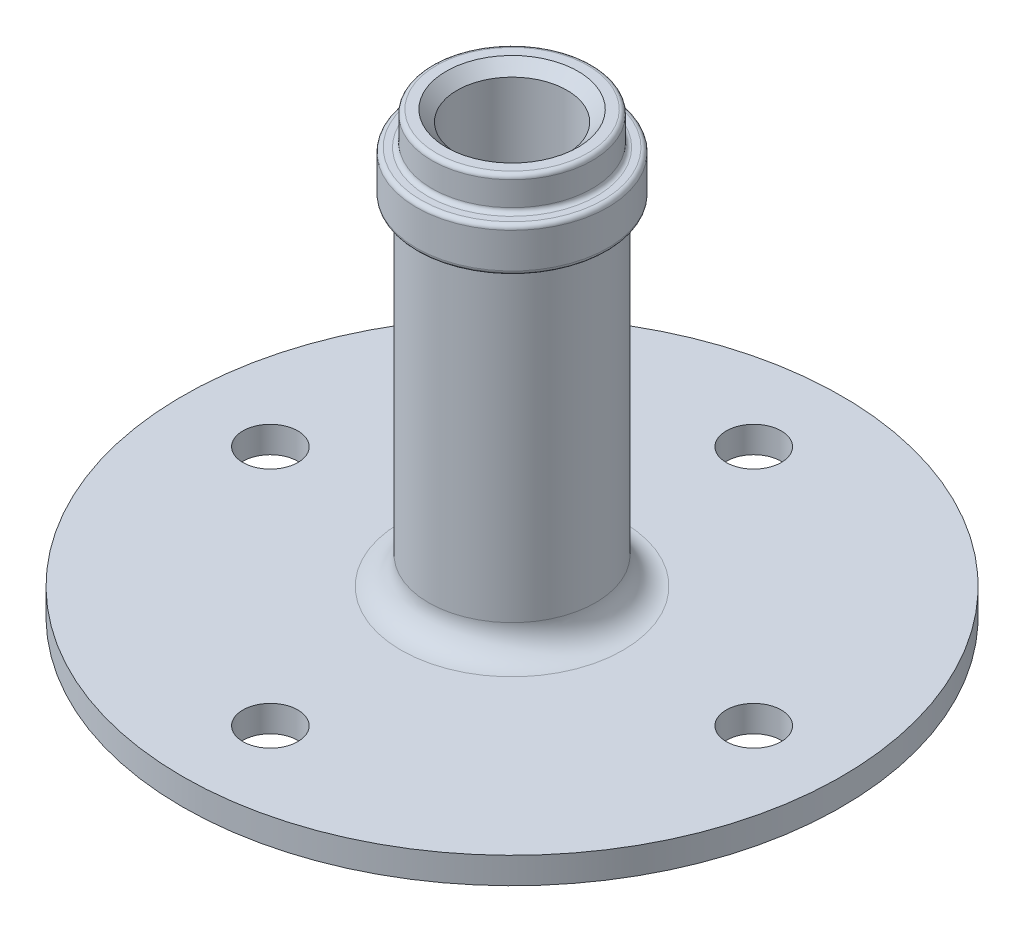
ISO-10303-21;
HEADER;
FILE_DESCRIPTION(('STEP AP214'),'2;1');
FILE_NAME('part.step','',(''),(''),'','','');
FILE_SCHEMA(('AUTOMOTIVE_DESIGN { 1 0 10303 214 1 1 1 1 }'));
ENDSEC;
DATA;
#1=APPLICATION_CONTEXT('core data for automotive mechanical design processes');
#2=APPLICATION_PROTOCOL_DEFINITION('international standard','automotive_design',2000,#1);
#3=PRODUCT_CONTEXT('',#1,'mechanical');
#4=PRODUCT('Part','Part','',(#3));
#5=PRODUCT_RELATED_PRODUCT_CATEGORY('part','',(#4));
#6=PRODUCT_DEFINITION_FORMATION('','',#4);
#7=PRODUCT_DEFINITION_CONTEXT('part definition',#1,'design');
#8=PRODUCT_DEFINITION('design','',#6,#7);
#9=PRODUCT_DEFINITION_SHAPE('','',#8);
#10=(LENGTH_UNIT() NAMED_UNIT(*) SI_UNIT(.MILLI.,.METRE.));
#11=(NAMED_UNIT(*) PLANE_ANGLE_UNIT() SI_UNIT($,.RADIAN.));
#12=(NAMED_UNIT(*) SI_UNIT($,.STERADIAN.) SOLID_ANGLE_UNIT());
#13=UNCERTAINTY_MEASURE_WITH_UNIT(LENGTH_MEASURE(1.E-05),#10,'distance_accuracy_value','');
#14=(GEOMETRIC_REPRESENTATION_CONTEXT(3) GLOBAL_UNCERTAINTY_ASSIGNED_CONTEXT((#13)) GLOBAL_UNIT_ASSIGNED_CONTEXT((#10,
#11,#12)) REPRESENTATION_CONTEXT('',''));
#15=CARTESIAN_POINT('',(0.,0.,0.));
#16=DIRECTION('',(0.,0.,1.));
#17=DIRECTION('',(1.,0.,0.));
#18=AXIS2_PLACEMENT_3D('',#15,#16,#17);
#19=CARTESIAN_POINT('',(0.,25.146,0.));
#20=DIRECTION('',(0.,1.,0.));
#21=DIRECTION('',(0.,0.,1.));
#22=AXIS2_PLACEMENT_3D('',#19,#20,#21);
#23=TOROIDAL_SURFACE('',#22,4.3815,0.254);
#24=CARTESIAN_POINT('',(0.,25.4,0.));
#25=DIRECTION('',(0.,1.,0.));
#26=DIRECTION('',(0.,0.,1.));
#27=AXIS2_PLACEMENT_3D('',#24,#25,#26);
#28=CIRCLE('',#27,4.3815);
#29=CARTESIAN_POINT('',(0.,25.4,4.3815));
#30=VERTEX_POINT('',#29);
#31=EDGE_CURVE('E357',#30,#30,#28,.T.);
#32=ORIENTED_EDGE('',*,*,#31,.F.);
#33=EDGE_LOOP('',(#32));
#34=FACE_BOUND('',#33,.T.);
#35=CARTESIAN_POINT('',(0.,25.146,0.));
#36=DIRECTION('',(0.,1.,0.));
#37=DIRECTION('',(0.,0.,1.));
#38=AXIS2_PLACEMENT_3D('',#35,#36,#37);
#39=CIRCLE('',#38,4.6355);
#40=CARTESIAN_POINT('',(0.,25.146,4.6355));
#41=VERTEX_POINT('',#40);
#42=EDGE_CURVE('E11',#41,#41,#39,.T.);
#43=ORIENTED_EDGE('',*,*,#42,.T.);
#44=EDGE_LOOP('',(#43));
#45=FACE_BOUND('',#44,.T.);
#46=ADVANCED_FACE('F302',(#34,#45),#23,.T.);
#47=CARTESIAN_POINT('',(0.,26.6065,0.));
#48=DIRECTION('',(0.,1.,0.));
#49=DIRECTION('',(0.,0.,1.));
#50=AXIS2_PLACEMENT_3D('',#47,#48,#49);
#51=CYLINDRICAL_SURFACE('',#50,4.6355);
#52=ORIENTED_EDGE('',*,*,#42,.F.);
#53=EDGE_LOOP('',(#52));
#54=FACE_BOUND('',#53,.T.);
#55=CARTESIAN_POINT('',(0.,23.749,0.));
#56=DIRECTION('',(0.,1.,0.));
#57=DIRECTION('',(0.,0.,1.));
#58=AXIS2_PLACEMENT_3D('',#55,#56,#57);
#59=CIRCLE('',#58,4.6355);
#60=CARTESIAN_POINT('',(0.,23.749,4.6355));
#61=VERTEX_POINT('',#60);
#62=EDGE_CURVE('E308',#61,#61,#59,.T.);
#63=ORIENTED_EDGE('',*,*,#62,.T.);
#64=EDGE_LOOP('',(#63));
#65=FACE_BOUND('',#64,.T.);
#66=ADVANCED_FACE('F441',(#54,#65),#51,.T.);
#67=CARTESIAN_POINT('',(0.,23.749,0.));
#68=DIRECTION('',(0.,1.,0.));
#69=DIRECTION('',(0.,0.,1.));
#70=AXIS2_PLACEMENT_3D('',#67,#68,#69);
#71=TOROIDAL_SURFACE('',#70,4.8895,0.254000000000001);
#72=ORIENTED_EDGE('',*,*,#62,.F.);
#73=EDGE_LOOP('',(#72));
#74=FACE_BOUND('',#73,.T.);
#75=CARTESIAN_POINT('',(0.,23.495,0.));
#76=DIRECTION('',(0.,1.,0.));
#77=DIRECTION('',(0.,0.,1.));
#78=AXIS2_PLACEMENT_3D('',#75,#76,#77);
#79=CIRCLE('',#78,4.8895);
#80=CARTESIAN_POINT('',(0.,23.495,4.8895));
#81=VERTEX_POINT('',#80);
#82=EDGE_CURVE('E312',#81,#81,#79,.T.);
#83=ORIENTED_EDGE('',*,*,#82,.T.);
#84=EDGE_LOOP('',(#83));
#85=FACE_BOUND('',#84,.T.);
#86=ADVANCED_FACE('F445',(#74,#85),#71,.F.);
#87=CARTESIAN_POINT('',(4.8895,23.495,0.));
#88=DIRECTION('',(0.,-1.,0.));
#89=DIRECTION('',(0.,0.,-1.));
#90=AXIS2_PLACEMENT_3D('',#87,#88,#89);
#91=PLANE('',#90);
#92=ORIENTED_EDGE('',*,*,#82,.F.);
#93=EDGE_LOOP('',(#92));
#94=FACE_BOUND('',#93,.T.);
#95=CARTESIAN_POINT('',(0.,23.495,0.));
#96=DIRECTION('',(0.,1.,0.));
#97=DIRECTION('',(0.,0.,1.));
#98=AXIS2_PLACEMENT_3D('',#95,#96,#97);
#99=CIRCLE('',#98,5.2705);
#100=CARTESIAN_POINT('',(0.,23.495,5.2705));
#101=VERTEX_POINT('',#100);
#102=EDGE_CURVE('E316',#101,#101,#99,.T.);
#103=ORIENTED_EDGE('',*,*,#102,.T.);
#104=EDGE_LOOP('',(#103));
#105=FACE_BOUND('',#104,.T.);
#106=ADVANCED_FACE('F450',(#94,#105),#91,.F.);
#107=CARTESIAN_POINT('',(0.,23.241,0.));
#108=DIRECTION('',(0.,1.,0.));
#109=DIRECTION('',(0.,0.,1.));
#110=AXIS2_PLACEMENT_3D('',#107,#108,#109);
#111=TOROIDAL_SURFACE('',#110,5.2705,0.254);
#112=ORIENTED_EDGE('',*,*,#102,.F.);
#113=EDGE_LOOP('',(#112));
#114=FACE_BOUND('',#113,.T.);
#115=CARTESIAN_POINT('',(0.,23.241,0.));
#116=DIRECTION('',(0.,1.,0.));
#117=DIRECTION('',(0.,0.,1.));
#118=AXIS2_PLACEMENT_3D('',#115,#116,#117);
#119=CIRCLE('',#118,5.5245);
#120=CARTESIAN_POINT('',(0.,23.241,5.5245));
#121=VERTEX_POINT('',#120);
#122=EDGE_CURVE('E321',#121,#121,#119,.T.);
#123=ORIENTED_EDGE('',*,*,#122,.T.);
#124=EDGE_LOOP('',(#123));
#125=FACE_BOUND('',#124,.T.);
#126=ADVANCED_FACE('F456',(#114,#125),#111,.T.);
#127=CARTESIAN_POINT('',(0.,26.6065,0.));
#128=DIRECTION('',(0.,1.,0.));
#129=DIRECTION('',(0.,0.,1.));
#130=AXIS2_PLACEMENT_3D('',#127,#128,#129);
#131=CYLINDRICAL_SURFACE('',#130,5.5245);
#132=ORIENTED_EDGE('',*,*,#122,.F.);
#133=EDGE_LOOP('',(#132));
#134=FACE_BOUND('',#133,.T.);
#135=CARTESIAN_POINT('',(0.,21.209,0.));
#136=DIRECTION('',(0.,1.,0.));
#137=DIRECTION('',(0.,0.,1.));
#138=AXIS2_PLACEMENT_3D('',#135,#136,#137);
#139=CIRCLE('',#138,5.5245);
#140=CARTESIAN_POINT('',(0.,21.209,5.5245));
#141=VERTEX_POINT('',#140);
#142=EDGE_CURVE('E324',#141,#141,#139,.T.);
#143=ORIENTED_EDGE('',*,*,#142,.T.);
#144=EDGE_LOOP('',(#143));
#145=FACE_BOUND('',#144,.T.);
#146=ADVANCED_FACE('F460',(#134,#145),#131,.T.);
#147=CARTESIAN_POINT('',(0.,21.209,0.));
#148=DIRECTION('',(0.,1.,0.));
#149=DIRECTION('',(0.,0.,1.));
#150=AXIS2_PLACEMENT_3D('',#147,#148,#149);
#151=TOROIDAL_SURFACE('',#150,5.2705,0.254);
#152=ORIENTED_EDGE('',*,*,#142,.F.);
#153=EDGE_LOOP('',(#152));
#154=FACE_BOUND('',#153,.T.);
#155=CARTESIAN_POINT('',(0.,20.955,0.));
#156=DIRECTION('',(0.,1.,0.));
#157=DIRECTION('',(0.,0.,1.));
#158=AXIS2_PLACEMENT_3D('',#155,#156,#157);
#159=CIRCLE('',#158,5.2705);
#160=CARTESIAN_POINT('',(0.,20.955,5.2705));
#161=VERTEX_POINT('',#160);
#162=EDGE_CURVE('E327',#161,#161,#159,.T.);
#163=ORIENTED_EDGE('',*,*,#162,.T.);
#164=EDGE_LOOP('',(#163));
#165=FACE_BOUND('',#164,.T.);
#166=ADVANCED_FACE('F464',(#154,#165),#151,.T.);
#167=CARTESIAN_POINT('',(5.2705,20.955,0.));
#168=DIRECTION('',(0.,1.,0.));
#169=DIRECTION('',(0.,0.,1.));
#170=AXIS2_PLACEMENT_3D('',#167,#168,#169);
#171=PLANE('',#170);
#172=ORIENTED_EDGE('',*,*,#162,.F.);
#173=EDGE_LOOP('',(#172));
#174=FACE_BOUND('',#173,.T.);
#175=CARTESIAN_POINT('',(0.,20.955,0.));
#176=DIRECTION('',(0.,1.,0.));
#177=DIRECTION('',(0.,0.,1.));
#178=AXIS2_PLACEMENT_3D('',#175,#176,#177);
#179=CIRCLE('',#178,5.08);
#180=CARTESIAN_POINT('',(0.,20.955,5.08));
#181=VERTEX_POINT('',#180);
#182=EDGE_CURVE('E330',#181,#181,#179,.T.);
#183=ORIENTED_EDGE('',*,*,#182,.T.);
#184=EDGE_LOOP('',(#183));
#185=FACE_BOUND('',#184,.T.);
#186=ADVANCED_FACE('F468',(#174,#185),#171,.F.);
#187=CARTESIAN_POINT('',(0.,20.701,0.));
#188=DIRECTION('',(0.,1.,0.));
#189=DIRECTION('',(0.,0.,1.));
#190=AXIS2_PLACEMENT_3D('',#187,#188,#189);
#191=TOROIDAL_SURFACE('',#190,5.08,0.254000000000001);
#192=ORIENTED_EDGE('',*,*,#182,.F.);
#193=EDGE_LOOP('',(#192));
#194=FACE_BOUND('',#193,.T.);
#195=CARTESIAN_POINT('',(0.,20.701,0.));
#196=DIRECTION('',(0.,1.,0.));
#197=DIRECTION('',(0.,0.,1.));
#198=AXIS2_PLACEMENT_3D('',#195,#196,#197);
#199=CIRCLE('',#198,4.826);
#200=CARTESIAN_POINT('',(0.,20.701,4.826));
#201=VERTEX_POINT('',#200);
#202=EDGE_CURVE('E333',#201,#201,#199,.T.);
#203=ORIENTED_EDGE('',*,*,#202,.T.);
#204=EDGE_LOOP('',(#203));
#205=FACE_BOUND('',#204,.T.);
#206=ADVANCED_FACE('F472',(#194,#205),#191,.F.);
#207=CARTESIAN_POINT('',(0.,26.6065,0.));
#208=DIRECTION('',(0.,1.,0.));
#209=DIRECTION('',(0.,0.,1.));
#210=AXIS2_PLACEMENT_3D('',#207,#208,#209);
#211=CYLINDRICAL_SURFACE('',#210,4.826);
#212=ORIENTED_EDGE('',*,*,#202,.F.);
#213=EDGE_LOOP('',(#212));
#214=FACE_BOUND('',#213,.T.);
#215=CARTESIAN_POINT('',(0.,3.1115,0.));
#216=DIRECTION('',(0.,1.,0.));
#217=DIRECTION('',(0.,0.,1.));
#218=AXIS2_PLACEMENT_3D('',#215,#216,#217);
#219=CIRCLE('',#218,4.826);
#220=CARTESIAN_POINT('',(0.,3.1115,4.826));
#221=VERTEX_POINT('',#220);
#222=EDGE_CURVE('E336',#221,#221,#219,.T.);
#223=ORIENTED_EDGE('',*,*,#222,.T.);
#224=EDGE_LOOP('',(#223));
#225=FACE_BOUND('',#224,.T.);
#226=ADVANCED_FACE('F476',(#214,#225),#211,.T.);
#227=CARTESIAN_POINT('',(0.,3.1115,0.));
#228=DIRECTION('',(0.,1.,0.));
#229=DIRECTION('',(0.,0.,1.));
#230=AXIS2_PLACEMENT_3D('',#227,#228,#229);
#231=TOROIDAL_SURFACE('',#230,6.4135,1.5875);
#232=ORIENTED_EDGE('',*,*,#222,.F.);
#233=EDGE_LOOP('',(#232));
#234=FACE_BOUND('',#233,.T.);
#235=CARTESIAN_POINT('',(0.,1.524,0.));
#236=DIRECTION('',(0.,1.,0.));
#237=DIRECTION('',(0.,0.,1.));
#238=AXIS2_PLACEMENT_3D('',#235,#236,#237);
#239=CIRCLE('',#238,6.4135);
#240=CARTESIAN_POINT('',(0.,1.524,6.4135));
#241=VERTEX_POINT('',#240);
#242=EDGE_CURVE('E339',#241,#241,#239,.T.);
#243=ORIENTED_EDGE('',*,*,#242,.T.);
#244=EDGE_LOOP('',(#243));
#245=FACE_BOUND('',#244,.T.);
#246=ADVANCED_FACE('F399',(#234,#245),#231,.F.);
#247=CARTESIAN_POINT('',(6.4135,1.524,0.));
#248=DIRECTION('',(0.,-1.,0.));
#249=DIRECTION('',(0.,0.,-1.));
#250=AXIS2_PLACEMENT_3D('',#247,#248,#249);
#251=PLANE('',#250);
#252=CARTESIAN_POINT('',(-13.97,1.524,0.));
#253=DIRECTION('',(0.,1.,0.));
#254=DIRECTION('',(0.,0.,1.));
#255=AXIS2_PLACEMENT_3D('',#252,#253,#254);
#256=CIRCLE('',#255,1.5875);
#257=CARTESIAN_POINT('',(-13.97,1.524,1.5875));
#258=VERTEX_POINT('',#257);
#259=EDGE_CURVE('E379',#258,#258,#256,.T.);
#260=ORIENTED_EDGE('',*,*,#259,.F.);
#261=EDGE_LOOP('',(#260));
#262=FACE_BOUND('',#261,.T.);
#263=CARTESIAN_POINT('',(0.,1.524,13.97));
#264=DIRECTION('',(0.,1.,0.));
#265=DIRECTION('',(0.,0.,1.));
#266=AXIS2_PLACEMENT_3D('',#263,#264,#265);
#267=CIRCLE('',#266,1.5875);
#268=CARTESIAN_POINT('',(0.,1.524,15.5575));
#269=VERTEX_POINT('',#268);
#270=EDGE_CURVE('E373',#269,#269,#267,.T.);
#271=ORIENTED_EDGE('',*,*,#270,.F.);
#272=EDGE_LOOP('',(#271));
#273=FACE_BOUND('',#272,.T.);
#274=CARTESIAN_POINT('',(13.97,1.524,0.));
#275=DIRECTION('',(0.,1.,0.));
#276=DIRECTION('',(0.,0.,1.));
#277=AXIS2_PLACEMENT_3D('',#274,#275,#276);
#278=CIRCLE('',#277,1.5875);
#279=CARTESIAN_POINT('',(13.97,1.524,1.5875));
#280=VERTEX_POINT('',#279);
#281=EDGE_CURVE('E367',#280,#280,#278,.T.);
#282=ORIENTED_EDGE('',*,*,#281,.F.);
#283=EDGE_LOOP('',(#282));
#284=FACE_BOUND('',#283,.T.);
#285=CARTESIAN_POINT('',(0.,1.524,-13.97));
#286=DIRECTION('',(0.,1.,0.));
#287=DIRECTION('',(0.,0.,1.));
#288=AXIS2_PLACEMENT_3D('',#285,#286,#287);
#289=CIRCLE('',#288,1.5875);
#290=CARTESIAN_POINT('',(0.,1.524,-12.3825));
#291=VERTEX_POINT('',#290);
#292=EDGE_CURVE('E361',#291,#291,#289,.T.);
#293=ORIENTED_EDGE('',*,*,#292,.F.);
#294=EDGE_LOOP('',(#293));
#295=FACE_BOUND('',#294,.T.);
#296=ORIENTED_EDGE('',*,*,#242,.F.);
#297=EDGE_LOOP('',(#296));
#298=FACE_BOUND('',#297,.T.);
#299=CARTESIAN_POINT('',(0.,1.524,0.));
#300=DIRECTION('',(0.,1.,0.));
#301=DIRECTION('',(0.,0.,1.));
#302=AXIS2_PLACEMENT_3D('',#299,#300,#301);
#303=CIRCLE('',#302,19.05);
#304=CARTESIAN_POINT('',(0.,1.524,19.05));
#305=VERTEX_POINT('',#304);
#306=EDGE_CURVE('E342',#305,#305,#303,.T.);
#307=ORIENTED_EDGE('',*,*,#306,.T.);
#308=EDGE_LOOP('',(#307));
#309=FACE_BOUND('',#308,.T.);
#310=ADVANCED_FACE('F395',(#262,#273,#284,#295,#298,#309),#251,.F.);
#311=CARTESIAN_POINT('',(0.,26.6065,0.));
#312=DIRECTION('',(0.,1.,0.));
#313=DIRECTION('',(0.,0.,1.));
#314=AXIS2_PLACEMENT_3D('',#311,#312,#313);
#315=CYLINDRICAL_SURFACE('',#314,19.05);
#316=ORIENTED_EDGE('',*,*,#306,.F.);
#317=EDGE_LOOP('',(#316));
#318=FACE_BOUND('',#317,.T.);
#319=CARTESIAN_POINT('',(0.,0.,0.));
#320=DIRECTION('',(0.,1.,0.));
#321=DIRECTION('',(0.,0.,1.));
#322=AXIS2_PLACEMENT_3D('',#319,#320,#321);
#323=CIRCLE('',#322,19.05);
#324=CARTESIAN_POINT('',(0.,0.,19.05));
#325=VERTEX_POINT('',#324);
#326=EDGE_CURVE('E345',#325,#325,#323,.T.);
#327=ORIENTED_EDGE('',*,*,#326,.T.);
#328=EDGE_LOOP('',(#327));
#329=FACE_BOUND('',#328,.T.);
#330=ADVANCED_FACE('F398',(#318,#329),#315,.T.);
#331=CARTESIAN_POINT('',(3.175,0.,0.));
#332=DIRECTION('',(0.,1.,0.));
#333=DIRECTION('',(0.,0.,1.));
#334=AXIS2_PLACEMENT_3D('',#331,#332,#333);
#335=PLANE('',#334);
#336=CARTESIAN_POINT('',(-13.97,0.,0.));
#337=DIRECTION('',(0.,1.,0.));
#338=DIRECTION('',(0.,0.,1.));
#339=AXIS2_PLACEMENT_3D('',#336,#337,#338);
#340=CIRCLE('',#339,1.5875);
#341=CARTESIAN_POINT('',(-13.97,0.,1.5875));
#342=VERTEX_POINT('',#341);
#343=EDGE_CURVE('E376',#342,#342,#340,.T.);
#344=ORIENTED_EDGE('',*,*,#343,.T.);
#345=EDGE_LOOP('',(#344));
#346=FACE_BOUND('',#345,.T.);
#347=CARTESIAN_POINT('',(0.,0.,13.97));
#348=DIRECTION('',(0.,1.,0.));
#349=DIRECTION('',(0.,0.,1.));
#350=AXIS2_PLACEMENT_3D('',#347,#348,#349);
#351=CIRCLE('',#350,1.5875);
#352=CARTESIAN_POINT('',(0.,0.,15.5575));
#353=VERTEX_POINT('',#352);
#354=EDGE_CURVE('E370',#353,#353,#351,.T.);
#355=ORIENTED_EDGE('',*,*,#354,.T.);
#356=EDGE_LOOP('',(#355));
#357=FACE_BOUND('',#356,.T.);
#358=CARTESIAN_POINT('',(13.97,0.,0.));
#359=DIRECTION('',(0.,1.,0.));
#360=DIRECTION('',(0.,0.,1.));
#361=AXIS2_PLACEMENT_3D('',#358,#359,#360);
#362=CIRCLE('',#361,1.5875);
#363=CARTESIAN_POINT('',(13.97,0.,1.5875));
#364=VERTEX_POINT('',#363);
#365=EDGE_CURVE('E364',#364,#364,#362,.T.);
#366=ORIENTED_EDGE('',*,*,#365,.T.);
#367=EDGE_LOOP('',(#366));
#368=FACE_BOUND('',#367,.T.);
#369=CARTESIAN_POINT('',(0.,0.,-13.97));
#370=DIRECTION('',(0.,1.,0.));
#371=DIRECTION('',(0.,0.,1.));
#372=AXIS2_PLACEMENT_3D('',#369,#370,#371);
#373=CIRCLE('',#372,1.5875);
#374=CARTESIAN_POINT('',(0.,0.,-12.3825));
#375=VERTEX_POINT('',#374);
#376=EDGE_CURVE('E360',#375,#375,#373,.T.);
#377=ORIENTED_EDGE('',*,*,#376,.T.);
#378=EDGE_LOOP('',(#377));
#379=FACE_BOUND('',#378,.T.);
#380=ORIENTED_EDGE('',*,*,#326,.F.);
#381=EDGE_LOOP('',(#380));
#382=FACE_BOUND('',#381,.T.);
#383=CARTESIAN_POINT('',(0.,0.,0.));
#384=DIRECTION('',(0.,1.,0.));
#385=DIRECTION('',(0.,0.,1.));
#386=AXIS2_PLACEMENT_3D('',#383,#384,#385);
#387=CIRCLE('',#386,3.175);
#388=CARTESIAN_POINT('',(0.,0.,3.175));
#389=VERTEX_POINT('',#388);
#390=EDGE_CURVE('E348',#389,#389,#387,.T.);
#391=ORIENTED_EDGE('',*,*,#390,.T.);
#392=EDGE_LOOP('',(#391));
#393=FACE_BOUND('',#392,.T.);
#394=ADVANCED_FACE('F385',(#346,#357,#368,#379,#382,#393),#335,.F.);
#395=CARTESIAN_POINT('',(0.,26.6065,0.));
#396=DIRECTION('',(0.,1.,0.));
#397=DIRECTION('',(0.,0.,1.));
#398=AXIS2_PLACEMENT_3D('',#395,#396,#397);
#399=CYLINDRICAL_SURFACE('',#398,3.175);
#400=ORIENTED_EDGE('',*,*,#390,.F.);
#401=EDGE_LOOP('',(#400));
#402=FACE_BOUND('',#401,.T.);
#403=CARTESIAN_POINT('',(0.,24.765,0.));
#404=DIRECTION('',(0.,1.,0.));
#405=DIRECTION('',(0.,0.,1.));
#406=AXIS2_PLACEMENT_3D('',#403,#404,#405);
#407=CIRCLE('',#406,3.175);
#408=CARTESIAN_POINT('',(0.,24.765,3.175));
#409=VERTEX_POINT('',#408);
#410=EDGE_CURVE('E351',#409,#409,#407,.T.);
#411=ORIENTED_EDGE('',*,*,#410,.T.);
#412=EDGE_LOOP('',(#411));
#413=FACE_BOUND('',#412,.T.);
#414=ADVANCED_FACE('F418',(#402,#413),#399,.F.);
#415=CARTESIAN_POINT('',(0.,25.4,0.));
#416=DIRECTION('',(0.,1.,0.));
#417=DIRECTION('',(0.,0.,1.));
#418=AXIS2_PLACEMENT_3D('',#415,#416,#417);
#419=CONICAL_SURFACE('',#418,3.81,0.785398163397448);
#420=ORIENTED_EDGE('',*,*,#410,.F.);
#421=EDGE_LOOP('',(#420));
#422=FACE_BOUND('',#421,.T.);
#423=CARTESIAN_POINT('',(0.,25.4,0.));
#424=DIRECTION('',(0.,1.,0.));
#425=DIRECTION('',(0.,0.,1.));
#426=AXIS2_PLACEMENT_3D('',#423,#424,#425);
#427=CIRCLE('',#426,3.81);
#428=CARTESIAN_POINT('',(0.,25.4,3.81));
#429=VERTEX_POINT('',#428);
#430=EDGE_CURVE('E354',#429,#429,#427,.T.);
#431=ORIENTED_EDGE('',*,*,#430,.T.);
#432=EDGE_LOOP('',(#431));
#433=FACE_BOUND('',#432,.T.);
#434=ADVANCED_FACE('F424',(#422,#433),#419,.F.);
#435=CARTESIAN_POINT('',(3.81,25.4,0.));
#436=DIRECTION('',(0.,-1.,0.));
#437=DIRECTION('',(0.,0.,-1.));
#438=AXIS2_PLACEMENT_3D('',#435,#436,#437);
#439=PLANE('',#438);
#440=ORIENTED_EDGE('',*,*,#430,.F.);
#441=EDGE_LOOP('',(#440));
#442=FACE_BOUND('',#441,.T.);
#443=ORIENTED_EDGE('',*,*,#31,.T.);
#444=EDGE_LOOP('',(#443));
#445=FACE_BOUND('',#444,.T.);
#446=ADVANCED_FACE('F430',(#442,#445),#439,.F.);
#447=CARTESIAN_POINT('',(0.,0.,-13.97));
#448=DIRECTION('',(0.,1.,0.));
#449=DIRECTION('',(0.,0.,1.));
#450=AXIS2_PLACEMENT_3D('',#447,#448,#449);
#451=CYLINDRICAL_SURFACE('',#450,1.5875);
#452=ORIENTED_EDGE('',*,*,#376,.F.);
#453=EDGE_LOOP('',(#452));
#454=FACE_BOUND('',#453,.T.);
#455=ORIENTED_EDGE('',*,*,#292,.T.);
#456=EDGE_LOOP('',(#455));
#457=FACE_BOUND('',#456,.T.);
#458=ADVANCED_FACE('F436',(#454,#457),#451,.F.);
#459=CARTESIAN_POINT('',(13.97,0.,0.));
#460=DIRECTION('',(0.,1.,0.));
#461=DIRECTION('',(0.,0.,1.));
#462=AXIS2_PLACEMENT_3D('',#459,#460,#461);
#463=CYLINDRICAL_SURFACE('',#462,1.5875);
#464=ORIENTED_EDGE('',*,*,#365,.F.);
#465=EDGE_LOOP('',(#464));
#466=FACE_BOUND('',#465,.T.);
#467=ORIENTED_EDGE('',*,*,#281,.T.);
#468=EDGE_LOOP('',(#467));
#469=FACE_BOUND('',#468,.T.);
#470=ADVANCED_FACE('F486',(#466,#469),#463,.F.);
#471=CARTESIAN_POINT('',(0.,0.,13.97));
#472=DIRECTION('',(0.,1.,0.));
#473=DIRECTION('',(0.,0.,1.));
#474=AXIS2_PLACEMENT_3D('',#471,#472,#473);
#475=CYLINDRICAL_SURFACE('',#474,1.5875);
#476=ORIENTED_EDGE('',*,*,#354,.F.);
#477=EDGE_LOOP('',(#476));
#478=FACE_BOUND('',#477,.T.);
#479=ORIENTED_EDGE('',*,*,#270,.T.);
#480=EDGE_LOOP('',(#479));
#481=FACE_BOUND('',#480,.T.);
#482=ADVANCED_FACE('F391',(#478,#481),#475,.F.);
#483=CARTESIAN_POINT('',(-13.97,0.,0.));
#484=DIRECTION('',(0.,1.,0.));
#485=DIRECTION('',(0.,0.,1.));
#486=AXIS2_PLACEMENT_3D('',#483,#484,#485);
#487=CYLINDRICAL_SURFACE('',#486,1.5875);
#488=ORIENTED_EDGE('',*,*,#343,.F.);
#489=EDGE_LOOP('',(#488));
#490=FACE_BOUND('',#489,.T.);
#491=ORIENTED_EDGE('',*,*,#259,.T.);
#492=EDGE_LOOP('',(#491));
#493=FACE_BOUND('',#492,.T.);
#494=ADVANCED_FACE('F388',(#490,#493),#487,.F.);
#495=CLOSED_SHELL('',(#46,#66,#86,#106,#126,#146,#166,#186,#206,#226,#246,#310,#330,#394,#414,
#434,#446,#458,#470,#482,#494));
#496=MANIFOLD_SOLID_BREP('B2',#495);
#497=ADVANCED_BREP_SHAPE_REPRESENTATION('',(#18,#496),#14);
#498=SHAPE_DEFINITION_REPRESENTATION(#9,#497);
ENDSEC;
END-ISO-10303-21;
